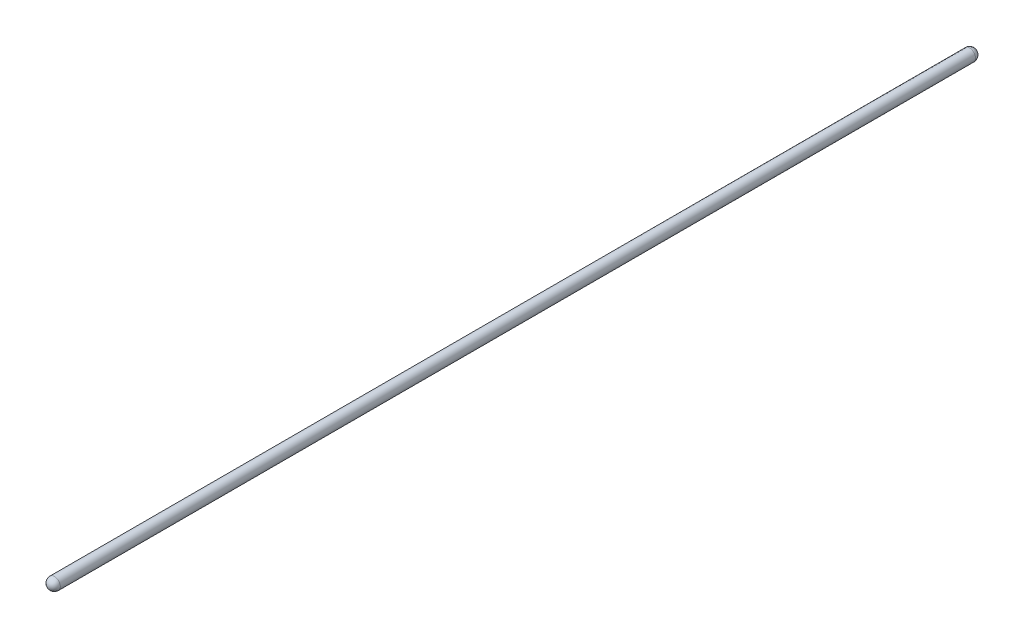
ISO-10303-21;
HEADER;
FILE_DESCRIPTION(('STEP AP214'),'2;1');
FILE_NAME('part.step','',(''),(''),'','','');
FILE_SCHEMA(('AUTOMOTIVE_DESIGN { 1 0 10303 214 1 1 1 1 }'));
ENDSEC;
DATA;
#1=APPLICATION_CONTEXT('core data for automotive mechanical design processes');
#2=APPLICATION_PROTOCOL_DEFINITION('international standard','automotive_design',2000,#1);
#3=PRODUCT_CONTEXT('',#1,'mechanical');
#4=PRODUCT('Part','Part','',(#3));
#5=PRODUCT_RELATED_PRODUCT_CATEGORY('part','',(#4));
#6=PRODUCT_DEFINITION_FORMATION('','',#4);
#7=PRODUCT_DEFINITION_CONTEXT('part definition',#1,'design');
#8=PRODUCT_DEFINITION('design','',#6,#7);
#9=PRODUCT_DEFINITION_SHAPE('','',#8);
#10=(LENGTH_UNIT() NAMED_UNIT(*) SI_UNIT(.MILLI.,.METRE.));
#11=(NAMED_UNIT(*) PLANE_ANGLE_UNIT() SI_UNIT($,.RADIAN.));
#12=(NAMED_UNIT(*) SI_UNIT($,.STERADIAN.) SOLID_ANGLE_UNIT());
#13=UNCERTAINTY_MEASURE_WITH_UNIT(LENGTH_MEASURE(1.E-05),#10,'distance_accuracy_value','');
#14=(GEOMETRIC_REPRESENTATION_CONTEXT(3) GLOBAL_UNCERTAINTY_ASSIGNED_CONTEXT((#13)) GLOBAL_UNIT_ASSIGNED_CONTEXT((#10,
#11,#12)) REPRESENTATION_CONTEXT('',''));
#15=CARTESIAN_POINT('',(0.,0.,0.));
#16=DIRECTION('',(0.,0.,1.));
#17=DIRECTION('',(1.,0.,0.));
#18=AXIS2_PLACEMENT_3D('',#15,#16,#17);
#19=CARTESIAN_POINT('',(0.,0.,0.));
#20=DIRECTION('',(0.,0.,-1.));
#21=DIRECTION('',(1.,0.,0.));
#22=AXIS2_PLACEMENT_3D('',#19,#20,#21);
#23=SPHERICAL_SURFACE('',#22,9.525);
#24=CARTESIAN_POINT('',(0.,0.,0.));
#25=DIRECTION('',(0.,0.,-1.));
#26=DIRECTION('',(-1.,0.,0.));
#27=AXIS2_PLACEMENT_3D('',#24,#25,#26);
#28=CIRCLE('',#27,9.525);
#29=CARTESIAN_POINT('',(-9.525,0.,0.));
#30=VERTEX_POINT('',#29);
#31=EDGE_CURVE('E10',#30,#30,#28,.T.);
#32=ORIENTED_EDGE('',*,*,#31,.T.);
#33=EDGE_LOOP('',(#32));
#34=FACE_BOUND('',#33,.T.);
#35=ADVANCED_FACE('F31',(#34),#23,.T.);
#36=CARTESIAN_POINT('',(0.,0.,-9.525));
#37=DIRECTION('',(0.,0.,-1.));
#38=DIRECTION('',(-1.,0.,0.));
#39=AXIS2_PLACEMENT_3D('',#36,#37,#38);
#40=CYLINDRICAL_SURFACE('',#39,9.52500000000001);
#41=ORIENTED_EDGE('',*,*,#31,.F.);
#42=EDGE_LOOP('',(#41));
#43=FACE_BOUND('',#42,.T.);
#44=CARTESIAN_POINT('',(1.80803791809117E-13,0.,1466.85));
#45=DIRECTION('',(0.,0.,-1.));
#46=DIRECTION('',(-1.,0.,0.));
#47=AXIS2_PLACEMENT_3D('',#44,#45,#46);
#48=CIRCLE('',#47,9.52500000000002);
#49=CARTESIAN_POINT('',(-9.52499999999984,0.,1466.85));
#50=VERTEX_POINT('',#49);
#51=EDGE_CURVE('E37',#50,#50,#48,.T.);
#52=ORIENTED_EDGE('',*,*,#51,.T.);
#53=EDGE_LOOP('',(#52));
#54=FACE_BOUND('',#53,.T.);
#55=ADVANCED_FACE('F43',(#43,#54),#40,.T.);
#56=CARTESIAN_POINT('',(0.,0.,1466.85));
#57=DIRECTION('',(0.,0.,-1.));
#58=DIRECTION('',(1.,0.,0.));
#59=AXIS2_PLACEMENT_3D('',#56,#57,#58);
#60=SPHERICAL_SURFACE('',#59,9.5250000000002);
#61=ORIENTED_EDGE('',*,*,#51,.F.);
#62=EDGE_LOOP('',(#61));
#63=FACE_BOUND('',#62,.T.);
#64=ADVANCED_FACE('F45',(#63),#60,.T.);
#65=CLOSED_SHELL('',(#35,#55,#64));
#66=MANIFOLD_SOLID_BREP('B2',#65);
#67=ADVANCED_BREP_SHAPE_REPRESENTATION('',(#18,#66),#14);
#68=SHAPE_DEFINITION_REPRESENTATION(#9,#67);
ENDSEC;
END-ISO-10303-21;
